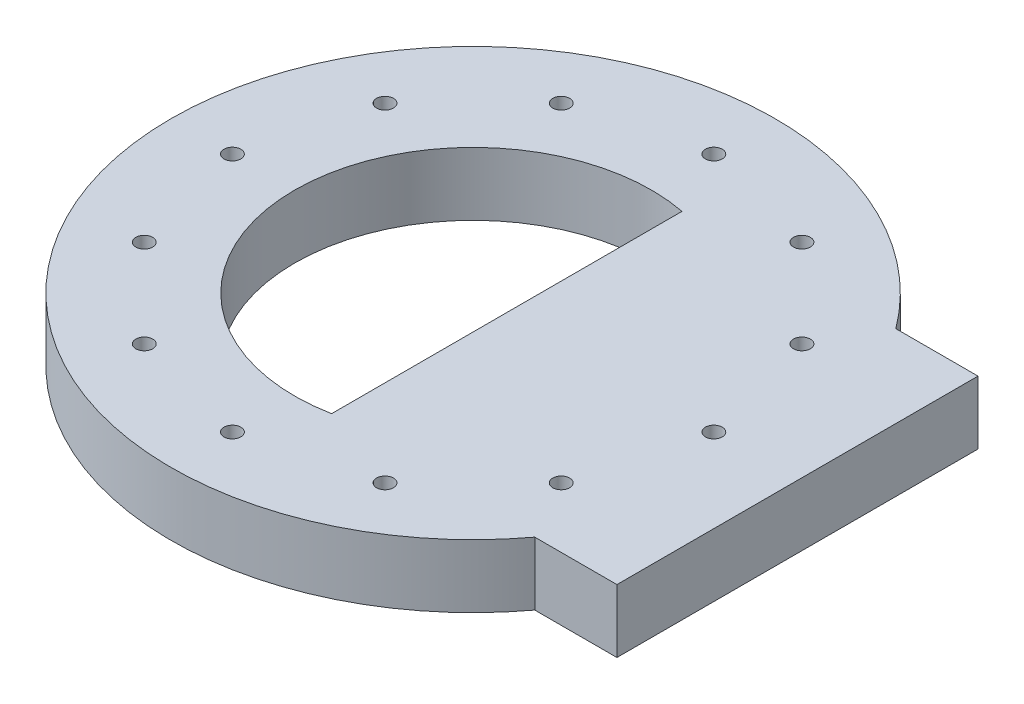
ISO-10303-21;
HEADER;
FILE_DESCRIPTION(('STEP AP214'),'2;1');
FILE_NAME('part.step','',(''),(''),'','','');
FILE_SCHEMA(('AUTOMOTIVE_DESIGN { 1 0 10303 214 1 1 1 1 }'));
ENDSEC;
DATA;
#1=APPLICATION_CONTEXT('core data for automotive mechanical design processes');
#2=APPLICATION_PROTOCOL_DEFINITION('international standard','automotive_design',2000,#1);
#3=PRODUCT_CONTEXT('',#1,'mechanical');
#4=PRODUCT('Part','Part','',(#3));
#5=PRODUCT_RELATED_PRODUCT_CATEGORY('part','',(#4));
#6=PRODUCT_DEFINITION_FORMATION('','',#4);
#7=PRODUCT_DEFINITION_CONTEXT('part definition',#1,'design');
#8=PRODUCT_DEFINITION('design','',#6,#7);
#9=PRODUCT_DEFINITION_SHAPE('','',#8);
#10=(LENGTH_UNIT() NAMED_UNIT(*) SI_UNIT(.MILLI.,.METRE.));
#11=(NAMED_UNIT(*) PLANE_ANGLE_UNIT() SI_UNIT($,.RADIAN.));
#12=(NAMED_UNIT(*) SI_UNIT($,.STERADIAN.) SOLID_ANGLE_UNIT());
#13=UNCERTAINTY_MEASURE_WITH_UNIT(LENGTH_MEASURE(1.E-05),#10,'distance_accuracy_value','');
#14=(GEOMETRIC_REPRESENTATION_CONTEXT(3) GLOBAL_UNCERTAINTY_ASSIGNED_CONTEXT((#13)) GLOBAL_UNIT_ASSIGNED_CONTEXT((#10,
#11,#12)) REPRESENTATION_CONTEXT('',''));
#15=CARTESIAN_POINT('',(0.,0.,0.));
#16=DIRECTION('',(0.,0.,1.));
#17=DIRECTION('',(1.,0.,0.));
#18=AXIS2_PLACEMENT_3D('',#15,#16,#17);
#19=CARTESIAN_POINT('',(0.,26.67,0.));
#20=DIRECTION('',(0.,1.,0.));
#21=DIRECTION('',(0.,0.,1.));
#22=AXIS2_PLACEMENT_3D('',#19,#20,#21);
#23=PLANE('',#22);
#24=CARTESIAN_POINT('',(-87.9881810244968,26.67,-50.7999999999962));
#25=DIRECTION('',(0.,1.,0.));
#26=DIRECTION('',(0.,0.,1.));
#27=AXIS2_PLACEMENT_3D('',#24,#25,#26);
#28=CIRCLE('',#27,3.56870000000436);
#29=CARTESIAN_POINT('',(-87.9881810244968,26.67,-47.2312999999918));
#30=VERTEX_POINT('',#29);
#31=EDGE_CURVE('E176',#30,#30,#28,.T.);
#32=ORIENTED_EDGE('',*,*,#31,.F.);
#33=EDGE_LOOP('',(#32));
#34=FACE_BOUND('',#33,.T.);
#35=CARTESIAN_POINT('',(-87.9881810244925,26.67,50.8000000000038));
#36=DIRECTION('',(0.,1.,0.));
#37=DIRECTION('',(0.,0.,1.));
#38=AXIS2_PLACEMENT_3D('',#35,#36,#37);
#39=CIRCLE('',#38,3.56870000000821);
#40=CARTESIAN_POINT('',(-87.9881810244925,26.67,54.368700000012));
#41=VERTEX_POINT('',#40);
#42=EDGE_CURVE('E164',#41,#41,#39,.T.);
#43=ORIENTED_EDGE('',*,*,#42,.F.);
#44=EDGE_LOOP('',(#43));
#45=FACE_BOUND('',#44,.T.);
#46=CARTESIAN_POINT('',(8.62560979994913E-12,26.67,101.6));
#47=DIRECTION('',(0.,1.,0.));
#48=DIRECTION('',(0.,0.,1.));
#49=AXIS2_PLACEMENT_3D('',#46,#47,#48);
#50=CIRCLE('',#49,3.56870000000893);
#51=CARTESIAN_POINT('',(8.62560979994913E-12,26.67,105.168700000009));
#52=VERTEX_POINT('',#51);
#53=EDGE_CURVE('E152',#52,#52,#50,.T.);
#54=ORIENTED_EDGE('',*,*,#53,.F.);
#55=EDGE_LOOP('',(#54));
#56=FACE_BOUND('',#55,.T.);
#57=CARTESIAN_POINT('',(87.9881810245054,26.67,50.7999999999963));
#58=DIRECTION('',(0.,1.,0.));
#59=DIRECTION('',(0.,0.,1.));
#60=AXIS2_PLACEMENT_3D('',#57,#58,#59);
#61=CIRCLE('',#60,3.56870000000556);
#62=CARTESIAN_POINT('',(87.9881810245054,26.67,54.3687000000018));
#63=VERTEX_POINT('',#62);
#64=EDGE_CURVE('E140',#63,#63,#61,.T.);
#65=ORIENTED_EDGE('',*,*,#64,.F.);
#66=EDGE_LOOP('',(#65));
#67=FACE_BOUND('',#66,.T.);
#68=CARTESIAN_POINT('',(87.9881810245011,26.67,-50.8000000000037));
#69=DIRECTION('',(0.,1.,0.));
#70=DIRECTION('',(0.,0.,1.));
#71=AXIS2_PLACEMENT_3D('',#68,#69,#70);
#72=CIRCLE('',#71,3.56870000000122);
#73=CARTESIAN_POINT('',(87.9881810245011,26.67,-47.2313000000025));
#74=VERTEX_POINT('',#73);
#75=EDGE_CURVE('E128',#74,#74,#72,.T.);
#76=ORIENTED_EDGE('',*,*,#75,.F.);
#77=EDGE_LOOP('',(#76));
#78=FACE_BOUND('',#77,.T.);
#79=CARTESIAN_POINT('',(0.,26.67,-101.6));
#80=DIRECTION('',(0.,1.,0.));
#81=DIRECTION('',(0.,0.,1.));
#82=AXIS2_PLACEMENT_3D('',#79,#80,#81);
#83=CIRCLE('',#82,3.5687);
#84=CARTESIAN_POINT('',(0.,26.67,-98.0313));
#85=VERTEX_POINT('',#84);
#86=EDGE_CURVE('E116',#85,#85,#83,.T.);
#87=ORIENTED_EDGE('',*,*,#86,.F.);
#88=EDGE_LOOP('',(#87));
#89=FACE_BOUND('',#88,.T.);
#90=CARTESIAN_POINT('',(0.,26.67,0.));
#91=DIRECTION('',(0.,1.,0.));
#92=DIRECTION('',(0.,0.,1.));
#93=AXIS2_PLACEMENT_3D('',#90,#91,#92);
#94=CIRCLE('',#93,127.508);
#95=CARTESIAN_POINT('',(102.234290059647,26.67,-76.2));
#96=VERTEX_POINT('',#95);
#97=CARTESIAN_POINT('',(102.234290059647,26.67,76.2));
#98=VERTEX_POINT('',#97);
#99=EDGE_CURVE('E11',#96,#98,#94,.T.);
#100=ORIENTED_EDGE('',*,*,#99,.T.);
#101=DIRECTION('',(1.,0.,0.));
#102=VECTOR('',#101,1.);
#103=CARTESIAN_POINT('',(136.906,26.67,76.2));
#104=LINE('',#103,#102);
#105=CARTESIAN_POINT('',(136.906,26.67,76.2));
#106=VERTEX_POINT('',#105);
#107=EDGE_CURVE('E205',#98,#106,#104,.T.);
#108=ORIENTED_EDGE('',*,*,#107,.T.);
#109=DIRECTION('',(0.,0.,-1.));
#110=VECTOR('',#109,1.);
#111=CARTESIAN_POINT('',(136.906,26.67,-76.2));
#112=LINE('',#111,#110);
#113=CARTESIAN_POINT('',(136.906,26.67,-76.2));
#114=VERTEX_POINT('',#113);
#115=EDGE_CURVE('E101',#106,#114,#112,.T.);
#116=ORIENTED_EDGE('',*,*,#115,.T.);
#117=DIRECTION('',(-1.,0.,0.));
#118=VECTOR('',#117,1.);
#119=CARTESIAN_POINT('',(136.906,26.67,-76.2));
#120=LINE('',#119,#118);
#121=EDGE_CURVE('E50',#114,#96,#120,.T.);
#122=ORIENTED_EDGE('',*,*,#121,.T.);
#123=EDGE_LOOP('',(#100,#108,#116,#122));
#124=FACE_BOUND('',#123,.T.);
#125=CARTESIAN_POINT('',(0.,26.67,0.));
#126=DIRECTION('',(0.,1.,0.));
#127=DIRECTION('',(0.,0.,1.));
#128=AXIS2_PLACEMENT_3D('',#125,#126,#127);
#129=CIRCLE('',#128,75.311);
#130=CARTESIAN_POINT('',(14.224,26.67,-73.9555579047309));
#131=VERTEX_POINT('',#130);
#132=CARTESIAN_POINT('',(14.224,26.67,73.9555579047309));
#133=VERTEX_POINT('',#132);
#134=EDGE_CURVE('E113',#131,#133,#129,.T.);
#135=ORIENTED_EDGE('',*,*,#134,.F.);
#136=DIRECTION('',(0.,0.,1.));
#137=VECTOR('',#136,1.);
#138=CARTESIAN_POINT('',(14.224,26.67,-73.9555579047309));
#139=LINE('',#138,#137);
#140=EDGE_CURVE('E195',#131,#133,#139,.T.);
#141=ORIENTED_EDGE('',*,*,#140,.T.);
#142=EDGE_LOOP('',(#135,#141));
#143=FACE_BOUND('',#142,.T.);
#144=CARTESIAN_POINT('',(50.8000000000001,26.67,-87.9881810244989));
#145=DIRECTION('',(0.,1.,0.));
#146=DIRECTION('',(0.,0.,1.));
#147=AXIS2_PLACEMENT_3D('',#144,#145,#146);
#148=CIRCLE('',#147,3.5687);
#149=CARTESIAN_POINT('',(50.8000000000001,26.67,-84.4194810244989));
#150=VERTEX_POINT('',#149);
#151=EDGE_CURVE('E122',#150,#150,#148,.T.);
#152=ORIENTED_EDGE('',*,*,#151,.F.);
#153=EDGE_LOOP('',(#152));
#154=FACE_BOUND('',#153,.T.);
#155=CARTESIAN_POINT('',(101.600000000004,26.67,-4.31280489997457E-12));
#156=DIRECTION('',(0.,1.,0.));
#157=DIRECTION('',(0.,0.,1.));
#158=AXIS2_PLACEMENT_3D('',#155,#156,#157);
#159=CIRCLE('',#158,3.56870000000321);
#160=CARTESIAN_POINT('',(101.600000000004,26.67,3.56869999999889));
#161=VERTEX_POINT('',#160);
#162=EDGE_CURVE('E134',#161,#161,#159,.T.);
#163=ORIENTED_EDGE('',*,*,#162,.F.);
#164=EDGE_LOOP('',(#163));
#165=FACE_BOUND('',#164,.T.);
#166=CARTESIAN_POINT('',(50.8000000000081,26.67,87.9881810244968));
#167=DIRECTION('',(0.,1.,0.));
#168=DIRECTION('',(0.,0.,1.));
#169=AXIS2_PLACEMENT_3D('',#166,#167,#168);
#170=CIRCLE('',#169,3.56870000000767);
#171=CARTESIAN_POINT('',(50.8000000000081,26.67,91.5568810245044));
#172=VERTEX_POINT('',#171);
#173=EDGE_CURVE('E146',#172,#172,#170,.T.);
#174=ORIENTED_EDGE('',*,*,#173,.F.);
#175=EDGE_LOOP('',(#174));
#176=FACE_BOUND('',#175,.T.);
#177=CARTESIAN_POINT('',(-50.7999999999919,26.67,87.9881810245011));
#178=DIRECTION('',(0.,1.,0.));
#179=DIRECTION('',(0.,0.,1.));
#180=AXIS2_PLACEMENT_3D('',#177,#178,#179);
#181=CIRCLE('',#180,3.56870000000915);
#182=CARTESIAN_POINT('',(-50.7999999999919,26.67,91.5568810245103));
#183=VERTEX_POINT('',#182);
#184=EDGE_CURVE('E158',#183,#183,#181,.T.);
#185=ORIENTED_EDGE('',*,*,#184,.F.);
#186=EDGE_LOOP('',(#185));
#187=FACE_BOUND('',#186,.T.);
#188=CARTESIAN_POINT('',(-101.599999999996,26.67,4.3252473114539E-12));
#189=DIRECTION('',(0.,1.,0.));
#190=DIRECTION('',(0.,0.,1.));
#191=AXIS2_PLACEMENT_3D('',#188,#189,#190);
#192=CIRCLE('',#191,3.56870000000642);
#193=CARTESIAN_POINT('',(-101.599999999996,26.67,3.56870000001074));
#194=VERTEX_POINT('',#193);
#195=EDGE_CURVE('E170',#194,#194,#192,.T.);
#196=ORIENTED_EDGE('',*,*,#195,.F.);
#197=EDGE_LOOP('',(#196));
#198=FACE_BOUND('',#197,.T.);
#199=CARTESIAN_POINT('',(-50.7999999999995,26.67,-87.9881810244968));
#200=DIRECTION('',(0.,1.,0.));
#201=DIRECTION('',(0.,0.,1.));
#202=AXIS2_PLACEMENT_3D('',#199,#200,#201);
#203=CIRCLE('',#202,3.56870000000249);
#204=CARTESIAN_POINT('',(-50.7999999999995,26.67,-84.4194810244943));
#205=VERTEX_POINT('',#204);
#206=EDGE_CURVE('E182',#205,#205,#203,.T.);
#207=ORIENTED_EDGE('',*,*,#206,.F.);
#208=EDGE_LOOP('',(#207));
#209=FACE_BOUND('',#208,.T.);
#210=ADVANCED_FACE('F36',(#34,#45,#56,#67,#78,#89,#124,#143,#154,#165,#176,#187,#198,#209),#23,.T.);
#211=CARTESIAN_POINT('',(0.,0.,0.));
#212=DIRECTION('',(0.,1.,0.));
#213=DIRECTION('',(0.,0.,1.));
#214=AXIS2_PLACEMENT_3D('',#211,#212,#213);
#215=PLANE('',#214);
#216=CARTESIAN_POINT('',(0.,0.,0.));
#217=DIRECTION('',(0.,1.,0.));
#218=DIRECTION('',(0.,0.,1.));
#219=AXIS2_PLACEMENT_3D('',#216,#217,#218);
#220=CIRCLE('',#219,127.508);
#221=CARTESIAN_POINT('',(102.234290059647,0.,-76.2));
#222=VERTEX_POINT('',#221);
#223=CARTESIAN_POINT('',(102.234290059647,0.,76.2));
#224=VERTEX_POINT('',#223);
#225=EDGE_CURVE('E40',#222,#224,#220,.T.);
#226=ORIENTED_EDGE('',*,*,#225,.F.);
#227=DIRECTION('',(-1.,0.,0.));
#228=VECTOR('',#227,1.);
#229=CARTESIAN_POINT('',(136.906,0.,-76.2));
#230=LINE('',#229,#228);
#231=CARTESIAN_POINT('',(136.906,0.,-76.2));
#232=VERTEX_POINT('',#231);
#233=EDGE_CURVE('E90',#232,#222,#230,.T.);
#234=ORIENTED_EDGE('',*,*,#233,.F.);
#235=DIRECTION('',(0.,0.,-1.));
#236=VECTOR('',#235,1.);
#237=CARTESIAN_POINT('',(136.906,0.,-76.2));
#238=LINE('',#237,#236);
#239=CARTESIAN_POINT('',(136.906,0.,76.2));
#240=VERTEX_POINT('',#239);
#241=EDGE_CURVE('E107',#240,#232,#238,.T.);
#242=ORIENTED_EDGE('',*,*,#241,.F.);
#243=DIRECTION('',(1.,0.,0.));
#244=VECTOR('',#243,1.);
#245=CARTESIAN_POINT('',(136.906,0.,76.2));
#246=LINE('',#245,#244);
#247=EDGE_CURVE('E100',#224,#240,#246,.T.);
#248=ORIENTED_EDGE('',*,*,#247,.F.);
#249=EDGE_LOOP('',(#226,#234,#242,#248));
#250=FACE_BOUND('',#249,.T.);
#251=CARTESIAN_POINT('',(0.,0.,0.));
#252=DIRECTION('',(0.,1.,0.));
#253=DIRECTION('',(0.,0.,1.));
#254=AXIS2_PLACEMENT_3D('',#251,#252,#253);
#255=CIRCLE('',#254,75.311);
#256=CARTESIAN_POINT('',(14.224,0.,-73.9555579047309));
#257=VERTEX_POINT('',#256);
#258=CARTESIAN_POINT('',(14.224,0.,73.9555579047309));
#259=VERTEX_POINT('',#258);
#260=EDGE_CURVE('E58',#257,#259,#255,.T.);
#261=ORIENTED_EDGE('',*,*,#260,.T.);
#262=DIRECTION('',(0.,0.,1.));
#263=VECTOR('',#262,1.);
#264=CARTESIAN_POINT('',(14.224,0.,-73.9555579047309));
#265=LINE('',#264,#263);
#266=EDGE_CURVE('E193',#257,#259,#265,.T.);
#267=ORIENTED_EDGE('',*,*,#266,.F.);
#268=EDGE_LOOP('',(#261,#267));
#269=FACE_BOUND('',#268,.T.);
#270=CARTESIAN_POINT('',(0.,0.,-101.6));
#271=DIRECTION('',(0.,1.,0.));
#272=DIRECTION('',(0.,0.,1.));
#273=AXIS2_PLACEMENT_3D('',#270,#271,#272);
#274=CIRCLE('',#273,3.5687);
#275=CARTESIAN_POINT('',(0.,0.,-98.0313));
#276=VERTEX_POINT('',#275);
#277=EDGE_CURVE('E119',#276,#276,#274,.T.);
#278=ORIENTED_EDGE('',*,*,#277,.T.);
#279=EDGE_LOOP('',(#278));
#280=FACE_BOUND('',#279,.T.);
#281=CARTESIAN_POINT('',(50.8000000000001,0.,-87.9881810244989));
#282=DIRECTION('',(0.,1.,0.));
#283=DIRECTION('',(0.,0.,1.));
#284=AXIS2_PLACEMENT_3D('',#281,#282,#283);
#285=CIRCLE('',#284,3.5687);
#286=CARTESIAN_POINT('',(50.8000000000001,0.,-84.4194810244989));
#287=VERTEX_POINT('',#286);
#288=EDGE_CURVE('E125',#287,#287,#285,.T.);
#289=ORIENTED_EDGE('',*,*,#288,.T.);
#290=EDGE_LOOP('',(#289));
#291=FACE_BOUND('',#290,.T.);
#292=CARTESIAN_POINT('',(87.9881810245011,0.,-50.8000000000037));
#293=DIRECTION('',(0.,1.,0.));
#294=DIRECTION('',(0.,0.,1.));
#295=AXIS2_PLACEMENT_3D('',#292,#293,#294);
#296=CIRCLE('',#295,3.56870000000122);
#297=CARTESIAN_POINT('',(87.9881810245011,0.,-47.2313000000025));
#298=VERTEX_POINT('',#297);
#299=EDGE_CURVE('E131',#298,#298,#296,.T.);
#300=ORIENTED_EDGE('',*,*,#299,.T.);
#301=EDGE_LOOP('',(#300));
#302=FACE_BOUND('',#301,.T.);
#303=CARTESIAN_POINT('',(101.600000000004,0.,-4.31280489997457E-12));
#304=DIRECTION('',(0.,1.,0.));
#305=DIRECTION('',(0.,0.,1.));
#306=AXIS2_PLACEMENT_3D('',#303,#304,#305);
#307=CIRCLE('',#306,3.56870000000321);
#308=CARTESIAN_POINT('',(101.600000000004,0.,3.56869999999889));
#309=VERTEX_POINT('',#308);
#310=EDGE_CURVE('E137',#309,#309,#307,.T.);
#311=ORIENTED_EDGE('',*,*,#310,.T.);
#312=EDGE_LOOP('',(#311));
#313=FACE_BOUND('',#312,.T.);
#314=CARTESIAN_POINT('',(87.9881810245054,0.,50.7999999999963));
#315=DIRECTION('',(0.,1.,0.));
#316=DIRECTION('',(0.,0.,1.));
#317=AXIS2_PLACEMENT_3D('',#314,#315,#316);
#318=CIRCLE('',#317,3.56870000000556);
#319=CARTESIAN_POINT('',(87.9881810245054,0.,54.3687000000018));
#320=VERTEX_POINT('',#319);
#321=EDGE_CURVE('E143',#320,#320,#318,.T.);
#322=ORIENTED_EDGE('',*,*,#321,.T.);
#323=EDGE_LOOP('',(#322));
#324=FACE_BOUND('',#323,.T.);
#325=CARTESIAN_POINT('',(50.8000000000081,0.,87.9881810244968));
#326=DIRECTION('',(0.,1.,0.));
#327=DIRECTION('',(0.,0.,1.));
#328=AXIS2_PLACEMENT_3D('',#325,#326,#327);
#329=CIRCLE('',#328,3.56870000000767);
#330=CARTESIAN_POINT('',(50.8000000000081,0.,91.5568810245044));
#331=VERTEX_POINT('',#330);
#332=EDGE_CURVE('E149',#331,#331,#329,.T.);
#333=ORIENTED_EDGE('',*,*,#332,.T.);
#334=EDGE_LOOP('',(#333));
#335=FACE_BOUND('',#334,.T.);
#336=CARTESIAN_POINT('',(8.62560979994913E-12,0.,101.6));
#337=DIRECTION('',(0.,1.,0.));
#338=DIRECTION('',(0.,0.,1.));
#339=AXIS2_PLACEMENT_3D('',#336,#337,#338);
#340=CIRCLE('',#339,3.56870000000893);
#341=CARTESIAN_POINT('',(8.62560979994913E-12,0.,105.168700000009));
#342=VERTEX_POINT('',#341);
#343=EDGE_CURVE('E155',#342,#342,#340,.T.);
#344=ORIENTED_EDGE('',*,*,#343,.T.);
#345=EDGE_LOOP('',(#344));
#346=FACE_BOUND('',#345,.T.);
#347=CARTESIAN_POINT('',(-50.7999999999919,0.,87.9881810245011));
#348=DIRECTION('',(0.,1.,0.));
#349=DIRECTION('',(0.,0.,1.));
#350=AXIS2_PLACEMENT_3D('',#347,#348,#349);
#351=CIRCLE('',#350,3.56870000000915);
#352=CARTESIAN_POINT('',(-50.7999999999919,0.,91.5568810245103));
#353=VERTEX_POINT('',#352);
#354=EDGE_CURVE('E161',#353,#353,#351,.T.);
#355=ORIENTED_EDGE('',*,*,#354,.T.);
#356=EDGE_LOOP('',(#355));
#357=FACE_BOUND('',#356,.T.);
#358=CARTESIAN_POINT('',(-87.9881810244925,0.,50.8000000000038));
#359=DIRECTION('',(0.,1.,0.));
#360=DIRECTION('',(0.,0.,1.));
#361=AXIS2_PLACEMENT_3D('',#358,#359,#360);
#362=CIRCLE('',#361,3.56870000000821);
#363=CARTESIAN_POINT('',(-87.9881810244925,0.,54.368700000012));
#364=VERTEX_POINT('',#363);
#365=EDGE_CURVE('E167',#364,#364,#362,.T.);
#366=ORIENTED_EDGE('',*,*,#365,.T.);
#367=EDGE_LOOP('',(#366));
#368=FACE_BOUND('',#367,.T.);
#369=CARTESIAN_POINT('',(-101.599999999996,0.,4.3252473114539E-12));
#370=DIRECTION('',(0.,1.,0.));
#371=DIRECTION('',(0.,0.,1.));
#372=AXIS2_PLACEMENT_3D('',#369,#370,#371);
#373=CIRCLE('',#372,3.56870000000642);
#374=CARTESIAN_POINT('',(-101.599999999996,0.,3.56870000001074));
#375=VERTEX_POINT('',#374);
#376=EDGE_CURVE('E173',#375,#375,#373,.T.);
#377=ORIENTED_EDGE('',*,*,#376,.T.);
#378=EDGE_LOOP('',(#377));
#379=FACE_BOUND('',#378,.T.);
#380=CARTESIAN_POINT('',(-87.9881810244968,0.,-50.7999999999962));
#381=DIRECTION('',(0.,1.,0.));
#382=DIRECTION('',(0.,0.,1.));
#383=AXIS2_PLACEMENT_3D('',#380,#381,#382);
#384=CIRCLE('',#383,3.56870000000436);
#385=CARTESIAN_POINT('',(-87.9881810244968,0.,-47.2312999999918));
#386=VERTEX_POINT('',#385);
#387=EDGE_CURVE('E179',#386,#386,#384,.T.);
#388=ORIENTED_EDGE('',*,*,#387,.T.);
#389=EDGE_LOOP('',(#388));
#390=FACE_BOUND('',#389,.T.);
#391=CARTESIAN_POINT('',(-50.7999999999995,0.,-87.9881810244968));
#392=DIRECTION('',(0.,1.,0.));
#393=DIRECTION('',(0.,0.,1.));
#394=AXIS2_PLACEMENT_3D('',#391,#392,#393);
#395=CIRCLE('',#394,3.56870000000249);
#396=CARTESIAN_POINT('',(-50.7999999999995,0.,-84.4194810244943));
#397=VERTEX_POINT('',#396);
#398=EDGE_CURVE('E185',#397,#397,#395,.T.);
#399=ORIENTED_EDGE('',*,*,#398,.T.);
#400=EDGE_LOOP('',(#399));
#401=FACE_BOUND('',#400,.T.);
#402=ADVANCED_FACE('F110',(#250,#269,#280,#291,#302,#313,#324,#335,#346,#357,#368,#379,#390,
#401),#215,.F.);
#403=CARTESIAN_POINT('',(0.,26.67,0.));
#404=DIRECTION('',(0.,-1.,0.));
#405=DIRECTION('',(0.,0.,-1.));
#406=AXIS2_PLACEMENT_3D('',#403,#404,#405);
#407=CYLINDRICAL_SURFACE('',#406,127.508);
#408=ORIENTED_EDGE('',*,*,#99,.F.);
#409=DIRECTION('',(0.,1.,0.));
#410=VECTOR('',#409,1.);
#411=CARTESIAN_POINT('',(102.234290059647,0.,-76.2));
#412=LINE('',#411,#410);
#413=EDGE_CURVE('E93',#222,#96,#412,.T.);
#414=ORIENTED_EDGE('',*,*,#413,.F.);
#415=ORIENTED_EDGE('',*,*,#225,.T.);
#416=DIRECTION('',(0.,1.,0.));
#417=VECTOR('',#416,1.);
#418=CARTESIAN_POINT('',(102.234290059647,0.,76.2));
#419=LINE('',#418,#417);
#420=EDGE_CURVE('E106',#224,#98,#419,.T.);
#421=ORIENTED_EDGE('',*,*,#420,.T.);
#422=EDGE_LOOP('',(#408,#414,#415,#421));
#423=FACE_BOUND('',#422,.T.);
#424=ADVANCED_FACE('F38',(#423),#407,.T.);
#425=CARTESIAN_POINT('',(0.,26.67,0.));
#426=DIRECTION('',(0.,-1.,0.));
#427=DIRECTION('',(0.,0.,-1.));
#428=AXIS2_PLACEMENT_3D('',#425,#426,#427);
#429=CYLINDRICAL_SURFACE('',#428,75.311);
#430=DIRECTION('',(0.,1.,0.));
#431=VECTOR('',#430,1.);
#432=CARTESIAN_POINT('',(14.224,0.,-73.9555579047309));
#433=LINE('',#432,#431);
#434=EDGE_CURVE('E191',#257,#131,#433,.T.);
#435=ORIENTED_EDGE('',*,*,#434,.T.);
#436=ORIENTED_EDGE('',*,*,#134,.T.);
#437=DIRECTION('',(0.,1.,0.));
#438=VECTOR('',#437,1.);
#439=CARTESIAN_POINT('',(14.224,0.,73.9555579047309));
#440=LINE('',#439,#438);
#441=EDGE_CURVE('E188',#259,#133,#440,.T.);
#442=ORIENTED_EDGE('',*,*,#441,.F.);
#443=ORIENTED_EDGE('',*,*,#260,.F.);
#444=EDGE_LOOP('',(#435,#436,#442,#443));
#445=FACE_BOUND('',#444,.T.);
#446=ADVANCED_FACE('F244',(#445),#429,.F.);
#447=CARTESIAN_POINT('',(0.,26.67,-101.6));
#448=DIRECTION('',(0.,-1.,0.));
#449=DIRECTION('',(0.,0.,-1.));
#450=AXIS2_PLACEMENT_3D('',#447,#448,#449);
#451=CYLINDRICAL_SURFACE('',#450,3.5687);
#452=ORIENTED_EDGE('',*,*,#86,.T.);
#453=EDGE_LOOP('',(#452));
#454=FACE_BOUND('',#453,.T.);
#455=ORIENTED_EDGE('',*,*,#277,.F.);
#456=EDGE_LOOP('',(#455));
#457=FACE_BOUND('',#456,.T.);
#458=ADVANCED_FACE('F248',(#454,#457),#451,.F.);
#459=CARTESIAN_POINT('',(50.8000000000001,26.67,-87.9881810244989));
#460=DIRECTION('',(0.,-1.,0.));
#461=DIRECTION('',(0.,0.,-1.));
#462=AXIS2_PLACEMENT_3D('',#459,#460,#461);
#463=CYLINDRICAL_SURFACE('',#462,3.5687);
#464=ORIENTED_EDGE('',*,*,#151,.T.);
#465=EDGE_LOOP('',(#464));
#466=FACE_BOUND('',#465,.T.);
#467=ORIENTED_EDGE('',*,*,#288,.F.);
#468=EDGE_LOOP('',(#467));
#469=FACE_BOUND('',#468,.T.);
#470=ADVANCED_FACE('F251',(#466,#469),#463,.F.);
#471=CARTESIAN_POINT('',(87.9881810245011,26.67,-50.8000000000037));
#472=DIRECTION('',(0.,-1.,0.));
#473=DIRECTION('',(0.,0.,-1.));
#474=AXIS2_PLACEMENT_3D('',#471,#472,#473);
#475=CYLINDRICAL_SURFACE('',#474,3.56870000000122);
#476=ORIENTED_EDGE('',*,*,#75,.T.);
#477=EDGE_LOOP('',(#476));
#478=FACE_BOUND('',#477,.T.);
#479=ORIENTED_EDGE('',*,*,#299,.F.);
#480=EDGE_LOOP('',(#479));
#481=FACE_BOUND('',#480,.T.);
#482=ADVANCED_FACE('F255',(#478,#481),#475,.F.);
#483=CARTESIAN_POINT('',(101.600000000004,26.67,-4.31280489997457E-12));
#484=DIRECTION('',(0.,-1.,0.));
#485=DIRECTION('',(0.,0.,-1.));
#486=AXIS2_PLACEMENT_3D('',#483,#484,#485);
#487=CYLINDRICAL_SURFACE('',#486,3.56870000000321);
#488=ORIENTED_EDGE('',*,*,#162,.T.);
#489=EDGE_LOOP('',(#488));
#490=FACE_BOUND('',#489,.T.);
#491=ORIENTED_EDGE('',*,*,#310,.F.);
#492=EDGE_LOOP('',(#491));
#493=FACE_BOUND('',#492,.T.);
#494=ADVANCED_FACE('F259',(#490,#493),#487,.F.);
#495=CARTESIAN_POINT('',(87.9881810245054,26.67,50.7999999999963));
#496=DIRECTION('',(0.,-1.,0.));
#497=DIRECTION('',(0.,0.,-1.));
#498=AXIS2_PLACEMENT_3D('',#495,#496,#497);
#499=CYLINDRICAL_SURFACE('',#498,3.56870000000556);
#500=ORIENTED_EDGE('',*,*,#64,.T.);
#501=EDGE_LOOP('',(#500));
#502=FACE_BOUND('',#501,.T.);
#503=ORIENTED_EDGE('',*,*,#321,.F.);
#504=EDGE_LOOP('',(#503));
#505=FACE_BOUND('',#504,.T.);
#506=ADVANCED_FACE('F263',(#502,#505),#499,.F.);
#507=CARTESIAN_POINT('',(50.8000000000081,26.67,87.9881810244968));
#508=DIRECTION('',(0.,-1.,0.));
#509=DIRECTION('',(0.,0.,-1.));
#510=AXIS2_PLACEMENT_3D('',#507,#508,#509);
#511=CYLINDRICAL_SURFACE('',#510,3.56870000000767);
#512=ORIENTED_EDGE('',*,*,#173,.T.);
#513=EDGE_LOOP('',(#512));
#514=FACE_BOUND('',#513,.T.);
#515=ORIENTED_EDGE('',*,*,#332,.F.);
#516=EDGE_LOOP('',(#515));
#517=FACE_BOUND('',#516,.T.);
#518=ADVANCED_FACE('F267',(#514,#517),#511,.F.);
#519=CARTESIAN_POINT('',(8.62560979994913E-12,26.67,101.6));
#520=DIRECTION('',(0.,-1.,0.));
#521=DIRECTION('',(0.,0.,-1.));
#522=AXIS2_PLACEMENT_3D('',#519,#520,#521);
#523=CYLINDRICAL_SURFACE('',#522,3.56870000000893);
#524=ORIENTED_EDGE('',*,*,#53,.T.);
#525=EDGE_LOOP('',(#524));
#526=FACE_BOUND('',#525,.T.);
#527=ORIENTED_EDGE('',*,*,#343,.F.);
#528=EDGE_LOOP('',(#527));
#529=FACE_BOUND('',#528,.T.);
#530=ADVANCED_FACE('F271',(#526,#529),#523,.F.);
#531=CARTESIAN_POINT('',(-50.7999999999919,26.67,87.9881810245011));
#532=DIRECTION('',(0.,-1.,0.));
#533=DIRECTION('',(0.,0.,-1.));
#534=AXIS2_PLACEMENT_3D('',#531,#532,#533);
#535=CYLINDRICAL_SURFACE('',#534,3.56870000000915);
#536=ORIENTED_EDGE('',*,*,#184,.T.);
#537=EDGE_LOOP('',(#536));
#538=FACE_BOUND('',#537,.T.);
#539=ORIENTED_EDGE('',*,*,#354,.F.);
#540=EDGE_LOOP('',(#539));
#541=FACE_BOUND('',#540,.T.);
#542=ADVANCED_FACE('F275',(#538,#541),#535,.F.);
#543=CARTESIAN_POINT('',(-87.9881810244925,26.67,50.8000000000038));
#544=DIRECTION('',(0.,-1.,0.));
#545=DIRECTION('',(0.,0.,-1.));
#546=AXIS2_PLACEMENT_3D('',#543,#544,#545);
#547=CYLINDRICAL_SURFACE('',#546,3.56870000000821);
#548=ORIENTED_EDGE('',*,*,#42,.T.);
#549=EDGE_LOOP('',(#548));
#550=FACE_BOUND('',#549,.T.);
#551=ORIENTED_EDGE('',*,*,#365,.F.);
#552=EDGE_LOOP('',(#551));
#553=FACE_BOUND('',#552,.T.);
#554=ADVANCED_FACE('F279',(#550,#553),#547,.F.);
#555=CARTESIAN_POINT('',(-101.599999999996,26.67,4.3252473114539E-12));
#556=DIRECTION('',(0.,-1.,0.));
#557=DIRECTION('',(0.,0.,-1.));
#558=AXIS2_PLACEMENT_3D('',#555,#556,#557);
#559=CYLINDRICAL_SURFACE('',#558,3.56870000000642);
#560=ORIENTED_EDGE('',*,*,#195,.T.);
#561=EDGE_LOOP('',(#560));
#562=FACE_BOUND('',#561,.T.);
#563=ORIENTED_EDGE('',*,*,#376,.F.);
#564=EDGE_LOOP('',(#563));
#565=FACE_BOUND('',#564,.T.);
#566=ADVANCED_FACE('F283',(#562,#565),#559,.F.);
#567=CARTESIAN_POINT('',(-87.9881810244968,26.67,-50.7999999999962));
#568=DIRECTION('',(0.,-1.,0.));
#569=DIRECTION('',(0.,0.,-1.));
#570=AXIS2_PLACEMENT_3D('',#567,#568,#569);
#571=CYLINDRICAL_SURFACE('',#570,3.56870000000436);
#572=ORIENTED_EDGE('',*,*,#31,.T.);
#573=EDGE_LOOP('',(#572));
#574=FACE_BOUND('',#573,.T.);
#575=ORIENTED_EDGE('',*,*,#387,.F.);
#576=EDGE_LOOP('',(#575));
#577=FACE_BOUND('',#576,.T.);
#578=ADVANCED_FACE('F236',(#574,#577),#571,.F.);
#579=CARTESIAN_POINT('',(-50.7999999999995,26.67,-87.9881810244968));
#580=DIRECTION('',(0.,-1.,0.));
#581=DIRECTION('',(0.,0.,-1.));
#582=AXIS2_PLACEMENT_3D('',#579,#580,#581);
#583=CYLINDRICAL_SURFACE('',#582,3.56870000000249);
#584=ORIENTED_EDGE('',*,*,#206,.T.);
#585=EDGE_LOOP('',(#584));
#586=FACE_BOUND('',#585,.T.);
#587=ORIENTED_EDGE('',*,*,#398,.F.);
#588=EDGE_LOOP('',(#587));
#589=FACE_BOUND('',#588,.T.);
#590=ADVANCED_FACE('F232',(#586,#589),#583,.F.);
#591=CARTESIAN_POINT('',(14.224,0.,-73.9555579047309));
#592=DIRECTION('',(-1.,0.,0.));
#593=DIRECTION('',(0.,0.,1.));
#594=AXIS2_PLACEMENT_3D('',#591,#592,#593);
#595=PLANE('',#594);
#596=ORIENTED_EDGE('',*,*,#140,.F.);
#597=ORIENTED_EDGE('',*,*,#434,.F.);
#598=ORIENTED_EDGE('',*,*,#266,.T.);
#599=ORIENTED_EDGE('',*,*,#441,.T.);
#600=EDGE_LOOP('',(#596,#597,#598,#599));
#601=FACE_BOUND('',#600,.T.);
#602=ADVANCED_FACE('F235',(#601),#595,.T.);
#603=CARTESIAN_POINT('',(136.906,0.,-76.2));
#604=DIRECTION('',(0.,0.,-1.));
#605=DIRECTION('',(-1.,0.,0.));
#606=AXIS2_PLACEMENT_3D('',#603,#604,#605);
#607=PLANE('',#606);
#608=ORIENTED_EDGE('',*,*,#121,.F.);
#609=DIRECTION('',(0.,1.,0.));
#610=VECTOR('',#609,1.);
#611=CARTESIAN_POINT('',(136.906,0.,-76.2));
#612=LINE('',#611,#610);
#613=EDGE_CURVE('E95',#232,#114,#612,.T.);
#614=ORIENTED_EDGE('',*,*,#613,.F.);
#615=ORIENTED_EDGE('',*,*,#233,.T.);
#616=ORIENTED_EDGE('',*,*,#413,.T.);
#617=EDGE_LOOP('',(#608,#614,#615,#616));
#618=FACE_BOUND('',#617,.T.);
#619=ADVANCED_FACE('F92',(#618),#607,.T.);
#620=CARTESIAN_POINT('',(136.906,0.,-76.2));
#621=DIRECTION('',(1.,0.,0.));
#622=DIRECTION('',(0.,0.,-1.));
#623=AXIS2_PLACEMENT_3D('',#620,#621,#622);
#624=PLANE('',#623);
#625=ORIENTED_EDGE('',*,*,#115,.F.);
#626=DIRECTION('',(0.,1.,0.));
#627=VECTOR('',#626,1.);
#628=CARTESIAN_POINT('',(136.906,0.,76.2));
#629=LINE('',#628,#627);
#630=EDGE_CURVE('E201',#240,#106,#629,.T.);
#631=ORIENTED_EDGE('',*,*,#630,.F.);
#632=ORIENTED_EDGE('',*,*,#241,.T.);
#633=ORIENTED_EDGE('',*,*,#613,.T.);
#634=EDGE_LOOP('',(#625,#631,#632,#633));
#635=FACE_BOUND('',#634,.T.);
#636=ADVANCED_FACE('F214',(#635),#624,.T.);
#637=CARTESIAN_POINT('',(136.906,0.,76.2));
#638=DIRECTION('',(0.,0.,1.));
#639=DIRECTION('',(1.,0.,0.));
#640=AXIS2_PLACEMENT_3D('',#637,#638,#639);
#641=PLANE('',#640);
#642=ORIENTED_EDGE('',*,*,#107,.F.);
#643=ORIENTED_EDGE('',*,*,#420,.F.);
#644=ORIENTED_EDGE('',*,*,#247,.T.);
#645=ORIENTED_EDGE('',*,*,#630,.T.);
#646=EDGE_LOOP('',(#642,#643,#644,#645));
#647=FACE_BOUND('',#646,.T.);
#648=ADVANCED_FACE('F211',(#647),#641,.T.);
#649=CLOSED_SHELL('',(#210,#402,#424,#446,#458,#470,#482,#494,#506,#518,#530,#542,#554,#566,
#578,#590,#602,#619,#636,#648));
#650=MANIFOLD_SOLID_BREP('B2',#649);
#651=ADVANCED_BREP_SHAPE_REPRESENTATION('',(#18,#650),#14);
#652=SHAPE_DEFINITION_REPRESENTATION(#9,#651);
ENDSEC;
END-ISO-10303-21;
